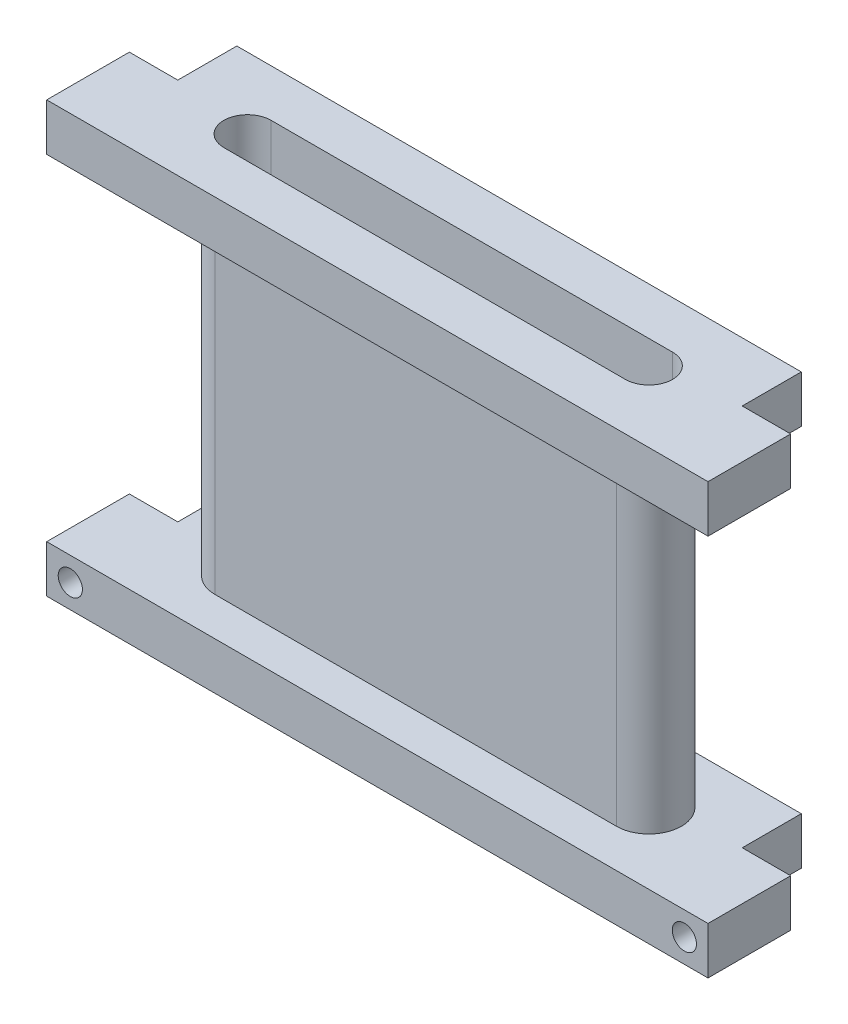
ISO-10303-21;
HEADER;
FILE_DESCRIPTION(('STEP AP214'),'2;1');
FILE_NAME('part.step','',(''),(''),'','','');
FILE_SCHEMA(('AUTOMOTIVE_DESIGN { 1 0 10303 214 1 1 1 1 }'));
ENDSEC;
DATA;
#1=APPLICATION_CONTEXT('core data for automotive mechanical design processes');
#2=APPLICATION_PROTOCOL_DEFINITION('international standard','automotive_design',2000,#1);
#3=PRODUCT_CONTEXT('',#1,'mechanical');
#4=PRODUCT('Part','Part','',(#3));
#5=PRODUCT_RELATED_PRODUCT_CATEGORY('part','',(#4));
#6=PRODUCT_DEFINITION_FORMATION('','',#4);
#7=PRODUCT_DEFINITION_CONTEXT('part definition',#1,'design');
#8=PRODUCT_DEFINITION('design','',#6,#7);
#9=PRODUCT_DEFINITION_SHAPE('','',#8);
#10=(LENGTH_UNIT() NAMED_UNIT(*) SI_UNIT(.MILLI.,.METRE.));
#11=(NAMED_UNIT(*) PLANE_ANGLE_UNIT() SI_UNIT($,.RADIAN.));
#12=(NAMED_UNIT(*) SI_UNIT($,.STERADIAN.) SOLID_ANGLE_UNIT());
#13=UNCERTAINTY_MEASURE_WITH_UNIT(LENGTH_MEASURE(1.E-05),#10,'distance_accuracy_value','');
#14=(GEOMETRIC_REPRESENTATION_CONTEXT(3) GLOBAL_UNCERTAINTY_ASSIGNED_CONTEXT((#13)) GLOBAL_UNIT_ASSIGNED_CONTEXT((#10,
#11,#12)) REPRESENTATION_CONTEXT('',''));
#15=CARTESIAN_POINT('',(0.,0.,0.));
#16=DIRECTION('',(0.,0.,1.));
#17=DIRECTION('',(1.,0.,0.));
#18=AXIS2_PLACEMENT_3D('',#15,#16,#17);
#19=CARTESIAN_POINT('',(-28.,-4.,2.750000002));
#20=DIRECTION('',(0.,0.,1.));
#21=DIRECTION('',(1.,0.,0.));
#22=AXIS2_PLACEMENT_3D('',#19,#20,#21);
#23=PLANE('',#22);
#24=DIRECTION('',(0.,-1.,0.));
#25=VECTOR('',#24,1.);
#26=CARTESIAN_POINT('',(-17.,28.4,2.75));
#27=LINE('',#26,#25);
#28=CARTESIAN_POINT('',(-17.,28.4,2.75));
#29=VERTEX_POINT('',#28);
#30=CARTESIAN_POINT('',(-17.,0.,2.750000002));
#31=VERTEX_POINT('',#30);
#32=EDGE_CURVE('E387',#29,#31,#27,.T.);
#33=ORIENTED_EDGE('',*,*,#32,.T.);
#34=DIRECTION('',(-1.,0.,0.));
#35=VECTOR('',#34,1.);
#36=CARTESIAN_POINT('',(-28.,0.,2.750000002));
#37=LINE('',#36,#35);
#38=CARTESIAN_POINT('',(17.,0.,2.750000002));
#39=VERTEX_POINT('',#38);
#40=EDGE_CURVE('E317',#39,#31,#37,.T.);
#41=ORIENTED_EDGE('',*,*,#40,.F.);
#42=DIRECTION('',(0.,-1.,0.));
#43=VECTOR('',#42,1.);
#44=CARTESIAN_POINT('',(17.,28.4,2.75));
#45=LINE('',#44,#43);
#46=CARTESIAN_POINT('',(17.,28.4,2.75));
#47=VERTEX_POINT('',#46);
#48=EDGE_CURVE('E374',#47,#39,#45,.T.);
#49=ORIENTED_EDGE('',*,*,#48,.F.);
#50=DIRECTION('',(1.,0.,0.));
#51=VECTOR('',#50,1.);
#52=CARTESIAN_POINT('',(17.,28.4,2.75));
#53=LINE('',#52,#51);
#54=EDGE_CURVE('E371',#29,#47,#53,.T.);
#55=ORIENTED_EDGE('',*,*,#54,.F.);
#56=EDGE_LOOP('',(#33,#41,#49,#55));
#57=FACE_BOUND('',#56,.T.);
#58=ADVANCED_FACE('F32',(#57),#23,.T.);
#59=CARTESIAN_POINT('',(28.,-4.,-6.));
#60=DIRECTION('',(0.,0.,-1.));
#61=DIRECTION('',(-1.,0.,0.));
#62=AXIS2_PLACEMENT_3D('',#59,#60,#61);
#63=PLANE('',#62);
#64=DIRECTION('',(0.,-1.,0.));
#65=VECTOR('',#64,1.);
#66=CARTESIAN_POINT('',(-23.899999996,32.4,-6.));
#67=LINE('',#66,#65);
#68=CARTESIAN_POINT('',(-23.899999996,0.,-6.));
#69=VERTEX_POINT('',#68);
#70=CARTESIAN_POINT('',(-23.899999996,-4.,-6.));
#71=VERTEX_POINT('',#70);
#72=EDGE_CURVE('E253',#69,#71,#67,.T.);
#73=ORIENTED_EDGE('',*,*,#72,.F.);
#74=DIRECTION('',(-1.,0.,0.));
#75=VECTOR('',#74,1.);
#76=CARTESIAN_POINT('',(28.,0.,-6.));
#77=LINE('',#76,#75);
#78=CARTESIAN_POINT('',(23.899999996,0.,-6.));
#79=VERTEX_POINT('',#78);
#80=EDGE_CURVE('E407',#79,#69,#77,.T.);
#81=ORIENTED_EDGE('',*,*,#80,.F.);
#82=DIRECTION('',(0.,-1.,0.));
#83=VECTOR('',#82,1.);
#84=CARTESIAN_POINT('',(23.899999996,32.4,-6.));
#85=LINE('',#84,#83);
#86=CARTESIAN_POINT('',(23.899999996,-4.,-6.));
#87=VERTEX_POINT('',#86);
#88=EDGE_CURVE('E274',#79,#87,#85,.T.);
#89=ORIENTED_EDGE('',*,*,#88,.T.);
#90=DIRECTION('',(-1.,0.,0.));
#91=VECTOR('',#90,1.);
#92=CARTESIAN_POINT('',(28.,-4.,-6.));
#93=LINE('',#92,#91);
#94=EDGE_CURVE('E404',#87,#71,#93,.T.);
#95=ORIENTED_EDGE('',*,*,#94,.T.);
#96=EDGE_LOOP('',(#73,#81,#89,#95));
#97=FACE_BOUND('',#96,.T.);
#98=ADVANCED_FACE('F34',(#97),#63,.T.);
#99=CARTESIAN_POINT('',(28.,-4.,2.750000002));
#100=DIRECTION('',(1.,0.,0.));
#101=DIRECTION('',(0.,0.,-1.));
#102=AXIS2_PLACEMENT_3D('',#99,#100,#101);
#103=PLANE('',#102);
#104=DIRECTION('',(0.,-1.,0.));
#105=VECTOR('',#104,1.);
#106=CARTESIAN_POINT('',(28.,32.4,-0.999999998999999));
#107=LINE('',#106,#105);
#108=CARTESIAN_POINT('',(28.,0.,-0.999999998999999));
#109=VERTEX_POINT('',#108);
#110=CARTESIAN_POINT('',(28.,-4.,-0.999999998999999));
#111=VERTEX_POINT('',#110);
#112=EDGE_CURVE('E271',#109,#111,#107,.T.);
#113=ORIENTED_EDGE('',*,*,#112,.F.);
#114=DIRECTION('',(0.,0.,-1.));
#115=VECTOR('',#114,1.);
#116=CARTESIAN_POINT('',(28.,0.,2.750000002));
#117=LINE('',#116,#115);
#118=CARTESIAN_POINT('',(28.,0.,6.));
#119=VERTEX_POINT('',#118);
#120=EDGE_CURVE('E401',#119,#109,#117,.T.);
#121=ORIENTED_EDGE('',*,*,#120,.F.);
#122=DIRECTION('',(0.,1.,0.));
#123=VECTOR('',#122,1.);
#124=CARTESIAN_POINT('',(28.,0.,6.));
#125=LINE('',#124,#123);
#126=CARTESIAN_POINT('',(28.,-4.,6.));
#127=VERTEX_POINT('',#126);
#128=EDGE_CURVE('E318',#127,#119,#125,.T.);
#129=ORIENTED_EDGE('',*,*,#128,.F.);
#130=DIRECTION('',(0.,0.,-1.));
#131=VECTOR('',#130,1.);
#132=CARTESIAN_POINT('',(28.,-4.,2.750000002));
#133=LINE('',#132,#131);
#134=EDGE_CURVE('E11',#127,#111,#133,.T.);
#135=ORIENTED_EDGE('',*,*,#134,.T.);
#136=EDGE_LOOP('',(#113,#121,#129,#135));
#137=FACE_BOUND('',#136,.T.);
#138=ADVANCED_FACE('F430',(#137),#103,.T.);
#139=CARTESIAN_POINT('',(-28.,-4.,-6.));
#140=DIRECTION('',(-1.,0.,0.));
#141=DIRECTION('',(0.,0.,1.));
#142=AXIS2_PLACEMENT_3D('',#139,#140,#141);
#143=PLANE('',#142);
#144=DIRECTION('',(0.,-1.,0.));
#145=VECTOR('',#144,1.);
#146=CARTESIAN_POINT('',(-28.,32.4,-1.));
#147=LINE('',#146,#145);
#148=CARTESIAN_POINT('',(-28.,0.,-1.));
#149=VERTEX_POINT('',#148);
#150=CARTESIAN_POINT('',(-28.,-4.,-1.));
#151=VERTEX_POINT('',#150);
#152=EDGE_CURVE('E254',#149,#151,#147,.T.);
#153=ORIENTED_EDGE('',*,*,#152,.T.);
#154=DIRECTION('',(0.,0.,1.));
#155=VECTOR('',#154,1.);
#156=CARTESIAN_POINT('',(-28.,-4.,-6.));
#157=LINE('',#156,#155);
#158=CARTESIAN_POINT('',(-28.,-4.,6.));
#159=VERTEX_POINT('',#158);
#160=EDGE_CURVE('E41',#151,#159,#157,.T.);
#161=ORIENTED_EDGE('',*,*,#160,.T.);
#162=DIRECTION('',(0.,-1.,0.));
#163=VECTOR('',#162,1.);
#164=CARTESIAN_POINT('',(-28.,-4.,6.));
#165=LINE('',#164,#163);
#166=CARTESIAN_POINT('',(-28.,0.,6.));
#167=VERTEX_POINT('',#166);
#168=EDGE_CURVE('E324',#167,#159,#165,.T.);
#169=ORIENTED_EDGE('',*,*,#168,.F.);
#170=DIRECTION('',(0.,0.,1.));
#171=VECTOR('',#170,1.);
#172=CARTESIAN_POINT('',(-28.,0.,-6.));
#173=LINE('',#172,#171);
#174=EDGE_CURVE('E405',#149,#167,#173,.T.);
#175=ORIENTED_EDGE('',*,*,#174,.F.);
#176=EDGE_LOOP('',(#153,#161,#169,#175));
#177=FACE_BOUND('',#176,.T.);
#178=ADVANCED_FACE('F434',(#177),#143,.T.);
#179=CARTESIAN_POINT('',(0.,-4.,0.));
#180=DIRECTION('',(0.,1.,0.));
#181=DIRECTION('',(0.,0.,1.));
#182=AXIS2_PLACEMENT_3D('',#179,#180,#181);
#183=PLANE('',#182);
#184=DIRECTION('',(1.,0.,0.));
#185=VECTOR('',#184,1.);
#186=CARTESIAN_POINT('',(-17.,-4.,-2.000000002));
#187=LINE('',#186,#185);
#188=CARTESIAN_POINT('',(-17.,-4.,-2.000000002));
#189=VERTEX_POINT('',#188);
#190=CARTESIAN_POINT('',(17.,-4.,-2.000000002));
#191=VERTEX_POINT('',#190);
#192=EDGE_CURVE('E233',#189,#191,#187,.T.);
#193=ORIENTED_EDGE('',*,*,#192,.F.);
#194=CARTESIAN_POINT('',(-17.,-4.,0.));
#195=DIRECTION('',(0.,-1.,0.));
#196=DIRECTION('',(0.,0.,-1.));
#197=AXIS2_PLACEMENT_3D('',#194,#195,#196);
#198=CIRCLE('',#197,2.000000002);
#199=CARTESIAN_POINT('',(-17.,-4.,2.000000002));
#200=VERTEX_POINT('',#199);
#201=EDGE_CURVE('E49',#200,#189,#198,.T.);
#202=ORIENTED_EDGE('',*,*,#201,.F.);
#203=DIRECTION('',(-1.,0.,0.));
#204=VECTOR('',#203,1.);
#205=CARTESIAN_POINT('',(17.,-4.,2.000000002));
#206=LINE('',#205,#204);
#207=CARTESIAN_POINT('',(17.,-4.,2.000000002));
#208=VERTEX_POINT('',#207);
#209=EDGE_CURVE('E224',#208,#200,#206,.T.);
#210=ORIENTED_EDGE('',*,*,#209,.F.);
#211=CARTESIAN_POINT('',(17.,-4.,0.));
#212=DIRECTION('',(0.,-1.,0.));
#213=DIRECTION('',(0.,0.,-1.));
#214=AXIS2_PLACEMENT_3D('',#211,#212,#213);
#215=CIRCLE('',#214,2.000000002);
#216=EDGE_CURVE('E236',#191,#208,#215,.T.);
#217=ORIENTED_EDGE('',*,*,#216,.F.);
#218=EDGE_LOOP('',(#193,#202,#210,#217));
#219=FACE_BOUND('',#218,.T.);
#220=ORIENTED_EDGE('',*,*,#160,.F.);
#221=DIRECTION('',(-1.,0.,0.));
#222=VECTOR('',#221,1.);
#223=CARTESIAN_POINT('',(-23.899999996,-4.,-0.999999999999999));
#224=LINE('',#223,#222);
#225=CARTESIAN_POINT('',(-23.899999996,-4.,-0.999999999999999));
#226=VERTEX_POINT('',#225);
#227=EDGE_CURVE('E251',#226,#151,#224,.T.);
#228=ORIENTED_EDGE('',*,*,#227,.F.);
#229=DIRECTION('',(0.,0.,1.));
#230=VECTOR('',#229,1.);
#231=CARTESIAN_POINT('',(-23.899999996,-4.,-6.));
#232=LINE('',#231,#230);
#233=EDGE_CURVE('E243',#71,#226,#232,.T.);
#234=ORIENTED_EDGE('',*,*,#233,.F.);
#235=ORIENTED_EDGE('',*,*,#94,.F.);
#236=DIRECTION('',(0.,0.,-1.));
#237=VECTOR('',#236,1.);
#238=CARTESIAN_POINT('',(23.899999996,-4.,-0.999999999));
#239=LINE('',#238,#237);
#240=CARTESIAN_POINT('',(23.899999996,-4.,-0.999999999));
#241=VERTEX_POINT('',#240);
#242=EDGE_CURVE('E268',#241,#87,#239,.T.);
#243=ORIENTED_EDGE('',*,*,#242,.F.);
#244=DIRECTION('',(-1.,0.,0.));
#245=VECTOR('',#244,1.);
#246=CARTESIAN_POINT('',(28.,-4.,-0.999999998999999));
#247=LINE('',#246,#245);
#248=EDGE_CURVE('E265',#111,#241,#247,.T.);
#249=ORIENTED_EDGE('',*,*,#248,.F.);
#250=ORIENTED_EDGE('',*,*,#134,.F.);
#251=DIRECTION('',(1.,0.,0.));
#252=VECTOR('',#251,1.);
#253=CARTESIAN_POINT('',(28.,-4.,6.));
#254=LINE('',#253,#252);
#255=EDGE_CURVE('E327',#159,#127,#254,.T.);
#256=ORIENTED_EDGE('',*,*,#255,.F.);
#257=EDGE_LOOP('',(#220,#228,#234,#235,#243,#249,#250,#256));
#258=FACE_BOUND('',#257,.T.);
#259=ADVANCED_FACE('F436',(#219,#258),#183,.F.);
#260=CARTESIAN_POINT('',(0.,0.,0.));
#261=DIRECTION('',(0.,1.,0.));
#262=DIRECTION('',(0.,0.,1.));
#263=AXIS2_PLACEMENT_3D('',#260,#261,#262);
#264=PLANE('',#263);
#265=DIRECTION('',(1.,0.,0.));
#266=VECTOR('',#265,1.);
#267=CARTESIAN_POINT('',(0.,0.,-0.999999999999996));
#268=LINE('',#267,#266);
#269=CARTESIAN_POINT('',(-23.899999996,0.,-0.999999999999999));
#270=VERTEX_POINT('',#269);
#271=EDGE_CURVE('E257',#149,#270,#268,.T.);
#272=ORIENTED_EDGE('',*,*,#271,.F.);
#273=ORIENTED_EDGE('',*,*,#174,.T.);
#274=DIRECTION('',(-1.,0.,0.));
#275=VECTOR('',#274,1.);
#276=CARTESIAN_POINT('',(-28.,0.,6.));
#277=LINE('',#276,#275);
#278=EDGE_CURVE('E321',#119,#167,#277,.T.);
#279=ORIENTED_EDGE('',*,*,#278,.F.);
#280=ORIENTED_EDGE('',*,*,#120,.T.);
#281=DIRECTION('',(1.,0.,0.));
#282=VECTOR('',#281,1.);
#283=CARTESIAN_POINT('',(0.,0.,-0.999999999000003));
#284=LINE('',#283,#282);
#285=CARTESIAN_POINT('',(23.899999996,0.,-0.999999999));
#286=VERTEX_POINT('',#285);
#287=EDGE_CURVE('E279',#286,#109,#284,.T.);
#288=ORIENTED_EDGE('',*,*,#287,.F.);
#289=DIRECTION('',(0.,0.,1.));
#290=VECTOR('',#289,1.);
#291=CARTESIAN_POINT('',(23.899999996,0.,0.));
#292=LINE('',#291,#290);
#293=EDGE_CURVE('E273',#79,#286,#292,.T.);
#294=ORIENTED_EDGE('',*,*,#293,.F.);
#295=ORIENTED_EDGE('',*,*,#80,.T.);
#296=DIRECTION('',(0.,0.,-1.));
#297=VECTOR('',#296,1.);
#298=CARTESIAN_POINT('',(-23.899999996,0.,0.));
#299=LINE('',#298,#297);
#300=EDGE_CURVE('E263',#270,#69,#299,.T.);
#301=ORIENTED_EDGE('',*,*,#300,.F.);
#302=EDGE_LOOP('',(#272,#273,#279,#280,#288,#294,#295,#301));
#303=FACE_BOUND('',#302,.T.);
#304=CARTESIAN_POINT('',(17.,0.,0.));
#305=DIRECTION('',(0.,1.,0.));
#306=DIRECTION('',(0.,0.,-1.));
#307=AXIS2_PLACEMENT_3D('',#304,#305,#306);
#308=CIRCLE('',#307,2.75);
#309=CARTESIAN_POINT('',(17.,0.,-2.75));
#310=VERTEX_POINT('',#309);
#311=EDGE_CURVE('E358',#39,#310,#308,.T.);
#312=ORIENTED_EDGE('',*,*,#311,.F.);
#313=ORIENTED_EDGE('',*,*,#40,.T.);
#314=CARTESIAN_POINT('',(-17.,0.,0.));
#315=DIRECTION('',(0.,1.,0.));
#316=DIRECTION('',(0.,0.,-1.));
#317=AXIS2_PLACEMENT_3D('',#314,#315,#316);
#318=CIRCLE('',#317,2.75);
#319=CARTESIAN_POINT('',(-17.,0.,-2.75));
#320=VERTEX_POINT('',#319);
#321=EDGE_CURVE('E365',#320,#31,#318,.T.);
#322=ORIENTED_EDGE('',*,*,#321,.F.);
#323=DIRECTION('',(-1.,0.,0.));
#324=VECTOR('',#323,1.);
#325=CARTESIAN_POINT('',(-17.,0.,-2.75));
#326=LINE('',#325,#324);
#327=EDGE_CURVE('E375',#310,#320,#326,.T.);
#328=ORIENTED_EDGE('',*,*,#327,.F.);
#329=EDGE_LOOP('',(#312,#313,#322,#328));
#330=FACE_BOUND('',#329,.T.);
#331=ADVANCED_FACE('F419',(#303,#330),#264,.T.);
#332=CARTESIAN_POINT('',(17.,28.4,0.));
#333=DIRECTION('',(0.,-1.,0.));
#334=DIRECTION('',(0.,0.,-1.));
#335=AXIS2_PLACEMENT_3D('',#332,#333,#334);
#336=CYLINDRICAL_SURFACE('',#335,2.75);
#337=ORIENTED_EDGE('',*,*,#311,.T.);
#338=DIRECTION('',(0.,-1.,0.));
#339=VECTOR('',#338,1.);
#340=CARTESIAN_POINT('',(17.,28.4,-2.75));
#341=LINE('',#340,#339);
#342=CARTESIAN_POINT('',(17.,28.4,-2.75));
#343=VERTEX_POINT('',#342);
#344=EDGE_CURVE('E392',#343,#310,#341,.T.);
#345=ORIENTED_EDGE('',*,*,#344,.F.);
#346=CARTESIAN_POINT('',(17.,28.4,0.));
#347=DIRECTION('',(0.,1.,0.));
#348=DIRECTION('',(0.,0.,-1.));
#349=AXIS2_PLACEMENT_3D('',#346,#347,#348);
#350=CIRCLE('',#349,2.75);
#351=EDGE_CURVE('E361',#47,#343,#350,.T.);
#352=ORIENTED_EDGE('',*,*,#351,.F.);
#353=ORIENTED_EDGE('',*,*,#48,.T.);
#354=EDGE_LOOP('',(#337,#345,#352,#353));
#355=FACE_BOUND('',#354,.T.);
#356=ADVANCED_FACE('F417',(#355),#336,.T.);
#357=CARTESIAN_POINT('',(-17.,28.4,-2.75));
#358=DIRECTION('',(0.,0.,1.));
#359=DIRECTION('',(1.,0.,0.));
#360=AXIS2_PLACEMENT_3D('',#357,#358,#359);
#361=PLANE('',#360);
#362=ORIENTED_EDGE('',*,*,#327,.T.);
#363=DIRECTION('',(0.,-1.,0.));
#364=VECTOR('',#363,1.);
#365=CARTESIAN_POINT('',(-17.,28.4,-2.75));
#366=LINE('',#365,#364);
#367=CARTESIAN_POINT('',(-17.,28.4,-2.75));
#368=VERTEX_POINT('',#367);
#369=EDGE_CURVE('E380',#368,#320,#366,.T.);
#370=ORIENTED_EDGE('',*,*,#369,.F.);
#371=DIRECTION('',(-1.,0.,0.));
#372=VECTOR('',#371,1.);
#373=CARTESIAN_POINT('',(-17.,28.4,-2.75));
#374=LINE('',#373,#372);
#375=EDGE_CURVE('E364',#343,#368,#374,.T.);
#376=ORIENTED_EDGE('',*,*,#375,.F.);
#377=ORIENTED_EDGE('',*,*,#344,.T.);
#378=EDGE_LOOP('',(#362,#370,#376,#377));
#379=FACE_BOUND('',#378,.T.);
#380=ADVANCED_FACE('F415',(#379),#361,.F.);
#381=CARTESIAN_POINT('',(-17.,28.4,0.));
#382=DIRECTION('',(0.,-1.,0.));
#383=DIRECTION('',(0.,0.,-1.));
#384=AXIS2_PLACEMENT_3D('',#381,#382,#383);
#385=CYLINDRICAL_SURFACE('',#384,2.75);
#386=ORIENTED_EDGE('',*,*,#321,.T.);
#387=ORIENTED_EDGE('',*,*,#32,.F.);
#388=CARTESIAN_POINT('',(-17.,28.4,0.));
#389=DIRECTION('',(0.,1.,0.));
#390=DIRECTION('',(0.,0.,-1.));
#391=AXIS2_PLACEMENT_3D('',#388,#389,#390);
#392=CIRCLE('',#391,2.75);
#393=EDGE_CURVE('E368',#368,#29,#392,.T.);
#394=ORIENTED_EDGE('',*,*,#393,.F.);
#395=ORIENTED_EDGE('',*,*,#369,.T.);
#396=EDGE_LOOP('',(#386,#387,#394,#395));
#397=FACE_BOUND('',#396,.T.);
#398=ADVANCED_FACE('F421',(#397),#385,.T.);
#399=CARTESIAN_POINT('',(28.,32.4,-6.));
#400=DIRECTION('',(1.,0.,0.));
#401=DIRECTION('',(0.,0.,-1.));
#402=AXIS2_PLACEMENT_3D('',#399,#400,#401);
#403=PLANE('',#402);
#404=DIRECTION('',(0.,1.,0.));
#405=VECTOR('',#404,1.);
#406=CARTESIAN_POINT('',(28.,-4.001,-0.999999999));
#407=LINE('',#406,#405);
#408=CARTESIAN_POINT('',(28.,28.4,-0.999999999));
#409=VERTEX_POINT('',#408);
#410=CARTESIAN_POINT('',(28.,32.4,-0.999999999));
#411=VERTEX_POINT('',#410);
#412=EDGE_CURVE('E290',#409,#411,#407,.T.);
#413=ORIENTED_EDGE('',*,*,#412,.T.);
#414=DIRECTION('',(0.,0.,1.));
#415=VECTOR('',#414,1.);
#416=CARTESIAN_POINT('',(28.,32.4,-6.));
#417=LINE('',#416,#415);
#418=CARTESIAN_POINT('',(28.,32.4,6.));
#419=VERTEX_POINT('',#418);
#420=EDGE_CURVE('E334',#411,#419,#417,.T.);
#421=ORIENTED_EDGE('',*,*,#420,.T.);
#422=DIRECTION('',(0.,-1.,0.));
#423=VECTOR('',#422,1.);
#424=CARTESIAN_POINT('',(28.,32.4,6.));
#425=LINE('',#424,#423);
#426=CARTESIAN_POINT('',(28.,28.4,6.));
#427=VERTEX_POINT('',#426);
#428=EDGE_CURVE('E346',#419,#427,#425,.T.);
#429=ORIENTED_EDGE('',*,*,#428,.T.);
#430=DIRECTION('',(0.,0.,1.));
#431=VECTOR('',#430,1.);
#432=CARTESIAN_POINT('',(28.,28.4,-6.));
#433=LINE('',#432,#431);
#434=EDGE_CURVE('E330',#409,#427,#433,.T.);
#435=ORIENTED_EDGE('',*,*,#434,.F.);
#436=EDGE_LOOP('',(#413,#421,#429,#435));
#437=FACE_BOUND('',#436,.T.);
#438=ADVANCED_FACE('F515',(#437),#403,.T.);
#439=CARTESIAN_POINT('',(-28.,32.4,-6.));
#440=DIRECTION('',(0.,0.,-1.));
#441=DIRECTION('',(-1.,0.,0.));
#442=AXIS2_PLACEMENT_3D('',#439,#440,#441);
#443=PLANE('',#442);
#444=DIRECTION('',(0.,1.,0.));
#445=VECTOR('',#444,1.);
#446=CARTESIAN_POINT('',(23.899999996,-4.001,-6.));
#447=LINE('',#446,#445);
#448=CARTESIAN_POINT('',(23.899999996,28.4,-6.));
#449=VERTEX_POINT('',#448);
#450=CARTESIAN_POINT('',(23.899999996,32.4,-6.));
#451=VERTEX_POINT('',#450);
#452=EDGE_CURVE('E289',#449,#451,#447,.T.);
#453=ORIENTED_EDGE('',*,*,#452,.F.);
#454=DIRECTION('',(1.,0.,0.));
#455=VECTOR('',#454,1.);
#456=CARTESIAN_POINT('',(-28.,28.4,-6.));
#457=LINE('',#456,#455);
#458=CARTESIAN_POINT('',(-23.899999996,28.4,-6.));
#459=VERTEX_POINT('',#458);
#460=EDGE_CURVE('E337',#459,#449,#457,.T.);
#461=ORIENTED_EDGE('',*,*,#460,.F.);
#462=DIRECTION('',(0.,1.,0.));
#463=VECTOR('',#462,1.);
#464=CARTESIAN_POINT('',(-23.899999996,-4.001,-6.));
#465=LINE('',#464,#463);
#466=CARTESIAN_POINT('',(-23.899999996,32.4,-6.));
#467=VERTEX_POINT('',#466);
#468=EDGE_CURVE('E308',#459,#467,#465,.T.);
#469=ORIENTED_EDGE('',*,*,#468,.T.);
#470=DIRECTION('',(1.,0.,0.));
#471=VECTOR('',#470,1.);
#472=CARTESIAN_POINT('',(-28.,32.4,-6.));
#473=LINE('',#472,#471);
#474=EDGE_CURVE('E343',#467,#451,#473,.T.);
#475=ORIENTED_EDGE('',*,*,#474,.T.);
#476=EDGE_LOOP('',(#453,#461,#469,#475));
#477=FACE_BOUND('',#476,.T.);
#478=ADVANCED_FACE('F511',(#477),#443,.T.);
#479=CARTESIAN_POINT('',(-28.,32.4,6.));
#480=DIRECTION('',(-1.,0.,0.));
#481=DIRECTION('',(0.,0.,1.));
#482=AXIS2_PLACEMENT_3D('',#479,#480,#481);
#483=PLANE('',#482);
#484=DIRECTION('',(0.,1.,0.));
#485=VECTOR('',#484,1.);
#486=CARTESIAN_POINT('',(-28.,-4.001,-1.));
#487=LINE('',#486,#485);
#488=CARTESIAN_POINT('',(-28.,28.4,-1.));
#489=VERTEX_POINT('',#488);
#490=CARTESIAN_POINT('',(-28.,32.4,-1.));
#491=VERTEX_POINT('',#490);
#492=EDGE_CURVE('E307',#489,#491,#487,.T.);
#493=ORIENTED_EDGE('',*,*,#492,.F.);
#494=DIRECTION('',(0.,0.,-1.));
#495=VECTOR('',#494,1.);
#496=CARTESIAN_POINT('',(-28.,28.4,6.));
#497=LINE('',#496,#495);
#498=CARTESIAN_POINT('',(-28.,28.4,6.));
#499=VERTEX_POINT('',#498);
#500=EDGE_CURVE('E351',#499,#489,#497,.T.);
#501=ORIENTED_EDGE('',*,*,#500,.F.);
#502=DIRECTION('',(0.,-1.,0.));
#503=VECTOR('',#502,1.);
#504=CARTESIAN_POINT('',(-28.,32.4,6.));
#505=LINE('',#504,#503);
#506=CARTESIAN_POINT('',(-28.,32.4,6.));
#507=VERTEX_POINT('',#506);
#508=EDGE_CURVE('E356',#507,#499,#505,.T.);
#509=ORIENTED_EDGE('',*,*,#508,.F.);
#510=DIRECTION('',(0.,0.,-1.));
#511=VECTOR('',#510,1.);
#512=CARTESIAN_POINT('',(-28.,32.4,6.));
#513=LINE('',#512,#511);
#514=EDGE_CURVE('E340',#507,#491,#513,.T.);
#515=ORIENTED_EDGE('',*,*,#514,.T.);
#516=EDGE_LOOP('',(#493,#501,#509,#515));
#517=FACE_BOUND('',#516,.T.);
#518=ADVANCED_FACE('F514',(#517),#483,.T.);
#519=CARTESIAN_POINT('',(28.,32.4,6.));
#520=DIRECTION('',(0.,0.,1.));
#521=DIRECTION('',(1.,0.,0.));
#522=AXIS2_PLACEMENT_3D('',#519,#520,#521);
#523=PLANE('',#522);
#524=DIRECTION('',(-1.,0.,0.));
#525=VECTOR('',#524,1.);
#526=CARTESIAN_POINT('',(28.,28.4,6.));
#527=LINE('',#526,#525);
#528=EDGE_CURVE('E348',#427,#499,#527,.T.);
#529=ORIENTED_EDGE('',*,*,#528,.F.);
#530=ORIENTED_EDGE('',*,*,#428,.F.);
#531=DIRECTION('',(-1.,0.,0.));
#532=VECTOR('',#531,1.);
#533=CARTESIAN_POINT('',(28.,32.4,6.));
#534=LINE('',#533,#532);
#535=EDGE_CURVE('E336',#419,#507,#534,.T.);
#536=ORIENTED_EDGE('',*,*,#535,.T.);
#537=ORIENTED_EDGE('',*,*,#508,.T.);
#538=EDGE_LOOP('',(#529,#530,#536,#537));
#539=FACE_BOUND('',#538,.T.);
#540=ADVANCED_FACE('F506',(#539),#523,.T.);
#541=CARTESIAN_POINT('',(0.,32.4,0.));
#542=DIRECTION('',(0.,-1.,0.));
#543=DIRECTION('',(0.,0.,-1.));
#544=AXIS2_PLACEMENT_3D('',#541,#542,#543);
#545=PLANE('',#544);
#546=DIRECTION('',(-1.,0.,0.));
#547=VECTOR('',#546,1.);
#548=CARTESIAN_POINT('',(17.,32.4,2.000000002));
#549=LINE('',#548,#547);
#550=CARTESIAN_POINT('',(17.,32.4,2.000000002));
#551=VERTEX_POINT('',#550);
#552=CARTESIAN_POINT('',(-17.,32.4,2.000000002));
#553=VERTEX_POINT('',#552);
#554=EDGE_CURVE('E228',#551,#553,#549,.T.);
#555=ORIENTED_EDGE('',*,*,#554,.T.);
#556=CARTESIAN_POINT('',(-17.,32.4,0.));
#557=DIRECTION('',(0.,-1.,0.));
#558=DIRECTION('',(0.,0.,-1.));
#559=AXIS2_PLACEMENT_3D('',#556,#557,#558);
#560=CIRCLE('',#559,2.000000002);
#561=CARTESIAN_POINT('',(-17.,32.4,-2.000000002));
#562=VERTEX_POINT('',#561);
#563=EDGE_CURVE('E220',#553,#562,#560,.T.);
#564=ORIENTED_EDGE('',*,*,#563,.T.);
#565=DIRECTION('',(1.,0.,0.));
#566=VECTOR('',#565,1.);
#567=CARTESIAN_POINT('',(-17.,32.4,-2.000000002));
#568=LINE('',#567,#566);
#569=CARTESIAN_POINT('',(17.,32.4,-2.000000002));
#570=VERTEX_POINT('',#569);
#571=EDGE_CURVE('E223',#562,#570,#568,.T.);
#572=ORIENTED_EDGE('',*,*,#571,.T.);
#573=CARTESIAN_POINT('',(17.,32.4,0.));
#574=DIRECTION('',(0.,-1.,0.));
#575=DIRECTION('',(0.,0.,-1.));
#576=AXIS2_PLACEMENT_3D('',#573,#574,#575);
#577=CIRCLE('',#576,2.000000002);
#578=EDGE_CURVE('E57',#570,#551,#577,.T.);
#579=ORIENTED_EDGE('',*,*,#578,.T.);
#580=EDGE_LOOP('',(#555,#564,#572,#579));
#581=FACE_BOUND('',#580,.T.);
#582=DIRECTION('',(1.,0.,0.));
#583=VECTOR('',#582,1.);
#584=CARTESIAN_POINT('',(23.899999996,32.4,-0.999999998999999));
#585=LINE('',#584,#583);
#586=CARTESIAN_POINT('',(23.899999996,32.4,-0.999999998999999));
#587=VERTEX_POINT('',#586);
#588=EDGE_CURVE('E287',#587,#411,#585,.T.);
#589=ORIENTED_EDGE('',*,*,#588,.F.);
#590=DIRECTION('',(0.,0.,1.));
#591=VECTOR('',#590,1.);
#592=CARTESIAN_POINT('',(23.899999996,32.4,-6.));
#593=LINE('',#592,#591);
#594=EDGE_CURVE('E284',#451,#587,#593,.T.);
#595=ORIENTED_EDGE('',*,*,#594,.F.);
#596=ORIENTED_EDGE('',*,*,#474,.F.);
#597=DIRECTION('',(0.,0.,-1.));
#598=VECTOR('',#597,1.);
#599=CARTESIAN_POINT('',(-23.899999996,32.4,-1.));
#600=LINE('',#599,#598);
#601=CARTESIAN_POINT('',(-23.899999996,32.4,-1.));
#602=VERTEX_POINT('',#601);
#603=EDGE_CURVE('E305',#602,#467,#600,.T.);
#604=ORIENTED_EDGE('',*,*,#603,.F.);
#605=DIRECTION('',(1.,0.,0.));
#606=VECTOR('',#605,1.);
#607=CARTESIAN_POINT('',(-28.,32.4,-1.));
#608=LINE('',#607,#606);
#609=EDGE_CURVE('E302',#491,#602,#608,.T.);
#610=ORIENTED_EDGE('',*,*,#609,.F.);
#611=ORIENTED_EDGE('',*,*,#514,.F.);
#612=ORIENTED_EDGE('',*,*,#535,.F.);
#613=ORIENTED_EDGE('',*,*,#420,.F.);
#614=EDGE_LOOP('',(#589,#595,#596,#604,#610,#611,#612,#613));
#615=FACE_BOUND('',#614,.T.);
#616=ADVANCED_FACE('F503',(#581,#615),#545,.F.);
#617=CARTESIAN_POINT('',(0.,28.4,0.));
#618=DIRECTION('',(0.,-1.,0.));
#619=DIRECTION('',(0.,0.,-1.));
#620=AXIS2_PLACEMENT_3D('',#617,#618,#619);
#621=PLANE('',#620);
#622=DIRECTION('',(0.,0.,1.));
#623=VECTOR('',#622,1.);
#624=CARTESIAN_POINT('',(23.899999996,28.4,-6.));
#625=LINE('',#624,#623);
#626=CARTESIAN_POINT('',(23.899999996,28.4,-0.999999998999999));
#627=VERTEX_POINT('',#626);
#628=EDGE_CURVE('E293',#449,#627,#625,.T.);
#629=ORIENTED_EDGE('',*,*,#628,.T.);
#630=DIRECTION('',(1.,0.,0.));
#631=VECTOR('',#630,1.);
#632=CARTESIAN_POINT('',(23.899999996,28.4,-0.999999998999999));
#633=LINE('',#632,#631);
#634=EDGE_CURVE('E281',#627,#409,#633,.T.);
#635=ORIENTED_EDGE('',*,*,#634,.T.);
#636=ORIENTED_EDGE('',*,*,#434,.T.);
#637=ORIENTED_EDGE('',*,*,#528,.T.);
#638=ORIENTED_EDGE('',*,*,#500,.T.);
#639=DIRECTION('',(1.,0.,0.));
#640=VECTOR('',#639,1.);
#641=CARTESIAN_POINT('',(-28.,28.4,-1.));
#642=LINE('',#641,#640);
#643=CARTESIAN_POINT('',(-23.899999996,28.4,-1.));
#644=VERTEX_POINT('',#643);
#645=EDGE_CURVE('E311',#489,#644,#642,.T.);
#646=ORIENTED_EDGE('',*,*,#645,.T.);
#647=DIRECTION('',(0.,0.,-1.));
#648=VECTOR('',#647,1.);
#649=CARTESIAN_POINT('',(-23.899999996,28.4,-1.));
#650=LINE('',#649,#648);
#651=EDGE_CURVE('E299',#644,#459,#650,.T.);
#652=ORIENTED_EDGE('',*,*,#651,.T.);
#653=ORIENTED_EDGE('',*,*,#460,.T.);
#654=EDGE_LOOP('',(#629,#635,#636,#637,#638,#646,#652,#653));
#655=FACE_BOUND('',#654,.T.);
#656=ORIENTED_EDGE('',*,*,#393,.T.);
#657=ORIENTED_EDGE('',*,*,#54,.T.);
#658=ORIENTED_EDGE('',*,*,#351,.T.);
#659=ORIENTED_EDGE('',*,*,#375,.T.);
#660=EDGE_LOOP('',(#656,#657,#658,#659));
#661=FACE_BOUND('',#660,.T.);
#662=ADVANCED_FACE('F424',(#655,#661),#621,.T.);
#663=CARTESIAN_POINT('',(0.,0.,6.));
#664=DIRECTION('',(0.,0.,-1.));
#665=DIRECTION('',(-1.,0.,0.));
#666=AXIS2_PLACEMENT_3D('',#663,#664,#665);
#667=PLANE('',#666);
#668=CARTESIAN_POINT('',(26.,-2.,6.));
#669=DIRECTION('',(0.,0.,1.));
#670=DIRECTION('',(1.,0.,0.));
#671=AXIS2_PLACEMENT_3D('',#668,#669,#670);
#672=CIRCLE('',#671,1.02499999999999);
#673=CARTESIAN_POINT('',(27.025,-2.,6.));
#674=VERTEX_POINT('',#673);
#675=EDGE_CURVE('E210',#674,#674,#672,.T.);
#676=ORIENTED_EDGE('',*,*,#675,.F.);
#677=EDGE_LOOP('',(#676));
#678=FACE_BOUND('',#677,.T.);
#679=CARTESIAN_POINT('',(-26.,-2.,6.));
#680=DIRECTION('',(0.,0.,1.));
#681=DIRECTION('',(1.,0.,0.));
#682=AXIS2_PLACEMENT_3D('',#679,#680,#681);
#683=CIRCLE('',#682,1.02499999999999);
#684=CARTESIAN_POINT('',(-24.975,-2.,6.));
#685=VERTEX_POINT('',#684);
#686=EDGE_CURVE('E209',#685,#685,#683,.T.);
#687=ORIENTED_EDGE('',*,*,#686,.F.);
#688=EDGE_LOOP('',(#687));
#689=FACE_BOUND('',#688,.T.);
#690=ORIENTED_EDGE('',*,*,#128,.T.);
#691=ORIENTED_EDGE('',*,*,#278,.T.);
#692=ORIENTED_EDGE('',*,*,#168,.T.);
#693=ORIENTED_EDGE('',*,*,#255,.T.);
#694=EDGE_LOOP('',(#690,#691,#692,#693));
#695=FACE_BOUND('',#694,.T.);
#696=ADVANCED_FACE('F457',(#678,#689,#695),#667,.F.);
#697=CARTESIAN_POINT('',(-28.,-4.001,-1.));
#698=DIRECTION('',(0.,0.,1.));
#699=DIRECTION('',(1.,0.,0.));
#700=AXIS2_PLACEMENT_3D('',#697,#698,#699);
#701=PLANE('',#700);
#702=ORIENTED_EDGE('',*,*,#492,.T.);
#703=ORIENTED_EDGE('',*,*,#609,.T.);
#704=DIRECTION('',(0.,1.,0.));
#705=VECTOR('',#704,1.);
#706=CARTESIAN_POINT('',(-23.899999996,-4.001,-1.));
#707=LINE('',#706,#705);
#708=EDGE_CURVE('E312',#644,#602,#707,.T.);
#709=ORIENTED_EDGE('',*,*,#708,.F.);
#710=ORIENTED_EDGE('',*,*,#645,.F.);
#711=EDGE_LOOP('',(#702,#703,#709,#710));
#712=FACE_BOUND('',#711,.T.);
#713=ADVANCED_FACE('F495',(#712),#701,.F.);
#714=CARTESIAN_POINT('',(-23.899999996,-4.001,-1.));
#715=DIRECTION('',(1.,0.,0.));
#716=DIRECTION('',(0.,0.,-1.));
#717=AXIS2_PLACEMENT_3D('',#714,#715,#716);
#718=PLANE('',#717);
#719=ORIENTED_EDGE('',*,*,#708,.T.);
#720=ORIENTED_EDGE('',*,*,#603,.T.);
#721=ORIENTED_EDGE('',*,*,#468,.F.);
#722=ORIENTED_EDGE('',*,*,#651,.F.);
#723=EDGE_LOOP('',(#719,#720,#721,#722));
#724=FACE_BOUND('',#723,.T.);
#725=ADVANCED_FACE('F491',(#724),#718,.F.);
#726=CARTESIAN_POINT('',(23.899999996,-4.001,-6.));
#727=DIRECTION('',(-1.,0.,0.));
#728=DIRECTION('',(0.,0.,1.));
#729=AXIS2_PLACEMENT_3D('',#726,#727,#728);
#730=PLANE('',#729);
#731=ORIENTED_EDGE('',*,*,#452,.T.);
#732=ORIENTED_EDGE('',*,*,#594,.T.);
#733=DIRECTION('',(0.,1.,0.));
#734=VECTOR('',#733,1.);
#735=CARTESIAN_POINT('',(23.899999996,-4.001,-0.999999998999999));
#736=LINE('',#735,#734);
#737=EDGE_CURVE('E294',#627,#587,#736,.T.);
#738=ORIENTED_EDGE('',*,*,#737,.F.);
#739=ORIENTED_EDGE('',*,*,#628,.F.);
#740=EDGE_LOOP('',(#731,#732,#738,#739));
#741=FACE_BOUND('',#740,.T.);
#742=ADVANCED_FACE('F484',(#741),#730,.F.);
#743=CARTESIAN_POINT('',(23.899999996,-4.001,-0.999999998999999));
#744=DIRECTION('',(0.,0.,1.));
#745=DIRECTION('',(1.,0.,0.));
#746=AXIS2_PLACEMENT_3D('',#743,#744,#745);
#747=PLANE('',#746);
#748=ORIENTED_EDGE('',*,*,#737,.T.);
#749=ORIENTED_EDGE('',*,*,#588,.T.);
#750=ORIENTED_EDGE('',*,*,#412,.F.);
#751=ORIENTED_EDGE('',*,*,#634,.F.);
#752=EDGE_LOOP('',(#748,#749,#750,#751));
#753=FACE_BOUND('',#752,.T.);
#754=ADVANCED_FACE('F477',(#753),#747,.F.);
#755=CARTESIAN_POINT('',(28.,32.4,-0.999999998999999));
#756=DIRECTION('',(0.,0.,1.));
#757=DIRECTION('',(1.,0.,0.));
#758=AXIS2_PLACEMENT_3D('',#755,#756,#757);
#759=PLANE('',#758);
#760=ORIENTED_EDGE('',*,*,#287,.T.);
#761=ORIENTED_EDGE('',*,*,#112,.T.);
#762=ORIENTED_EDGE('',*,*,#248,.T.);
#763=DIRECTION('',(0.,-1.,0.));
#764=VECTOR('',#763,1.);
#765=CARTESIAN_POINT('',(23.899999996,32.4,-0.999999999));
#766=LINE('',#765,#764);
#767=EDGE_CURVE('E270',#286,#241,#766,.T.);
#768=ORIENTED_EDGE('',*,*,#767,.F.);
#769=EDGE_LOOP('',(#760,#761,#762,#768));
#770=FACE_BOUND('',#769,.T.);
#771=ADVANCED_FACE('F475',(#770),#759,.F.);
#772=CARTESIAN_POINT('',(23.899999996,32.4,-0.999999999));
#773=DIRECTION('',(-1.,0.,0.));
#774=DIRECTION('',(0.,0.,1.));
#775=AXIS2_PLACEMENT_3D('',#772,#773,#774);
#776=PLANE('',#775);
#777=ORIENTED_EDGE('',*,*,#293,.T.);
#778=ORIENTED_EDGE('',*,*,#767,.T.);
#779=ORIENTED_EDGE('',*,*,#242,.T.);
#780=ORIENTED_EDGE('',*,*,#88,.F.);
#781=EDGE_LOOP('',(#777,#778,#779,#780));
#782=FACE_BOUND('',#781,.T.);
#783=ADVANCED_FACE('F472',(#782),#776,.F.);
#784=CARTESIAN_POINT('',(-23.899999996,32.4,-6.));
#785=DIRECTION('',(1.,0.,0.));
#786=DIRECTION('',(0.,0.,-1.));
#787=AXIS2_PLACEMENT_3D('',#784,#785,#786);
#788=PLANE('',#787);
#789=ORIENTED_EDGE('',*,*,#300,.T.);
#790=ORIENTED_EDGE('',*,*,#72,.T.);
#791=ORIENTED_EDGE('',*,*,#233,.T.);
#792=DIRECTION('',(0.,-1.,0.));
#793=VECTOR('',#792,1.);
#794=CARTESIAN_POINT('',(-23.899999996,32.4,-0.999999999999999));
#795=LINE('',#794,#793);
#796=EDGE_CURVE('E258',#270,#226,#795,.T.);
#797=ORIENTED_EDGE('',*,*,#796,.F.);
#798=EDGE_LOOP('',(#789,#790,#791,#797));
#799=FACE_BOUND('',#798,.T.);
#800=ADVANCED_FACE('F465',(#799),#788,.F.);
#801=CARTESIAN_POINT('',(-23.899999996,32.4,-0.999999999999999));
#802=DIRECTION('',(0.,0.,1.));
#803=DIRECTION('',(1.,0.,0.));
#804=AXIS2_PLACEMENT_3D('',#801,#802,#803);
#805=PLANE('',#804);
#806=ORIENTED_EDGE('',*,*,#271,.T.);
#807=ORIENTED_EDGE('',*,*,#796,.T.);
#808=ORIENTED_EDGE('',*,*,#227,.T.);
#809=ORIENTED_EDGE('',*,*,#152,.F.);
#810=EDGE_LOOP('',(#806,#807,#808,#809));
#811=FACE_BOUND('',#810,.T.);
#812=ADVANCED_FACE('F463',(#811),#805,.F.);
#813=CARTESIAN_POINT('',(-17.,32.4,0.));
#814=DIRECTION('',(0.,-1.,0.));
#815=DIRECTION('',(0.,0.,-1.));
#816=AXIS2_PLACEMENT_3D('',#813,#814,#815);
#817=CYLINDRICAL_SURFACE('',#816,2.000000002);
#818=ORIENTED_EDGE('',*,*,#201,.T.);
#819=DIRECTION('',(0.,-1.,0.));
#820=VECTOR('',#819,1.);
#821=CARTESIAN_POINT('',(-17.,32.4,-2.000000002));
#822=LINE('',#821,#820);
#823=EDGE_CURVE('E231',#562,#189,#822,.T.);
#824=ORIENTED_EDGE('',*,*,#823,.F.);
#825=ORIENTED_EDGE('',*,*,#563,.F.);
#826=DIRECTION('',(0.,-1.,0.));
#827=VECTOR('',#826,1.);
#828=CARTESIAN_POINT('',(-17.,32.4,2.000000002));
#829=LINE('',#828,#827);
#830=EDGE_CURVE('E241',#553,#200,#829,.T.);
#831=ORIENTED_EDGE('',*,*,#830,.T.);
#832=EDGE_LOOP('',(#818,#824,#825,#831));
#833=FACE_BOUND('',#832,.T.);
#834=ADVANCED_FACE('F681',(#833),#817,.F.);
#835=CARTESIAN_POINT('',(17.,32.4,2.000000002));
#836=DIRECTION('',(0.,0.,1.));
#837=DIRECTION('',(1.,0.,0.));
#838=AXIS2_PLACEMENT_3D('',#835,#836,#837);
#839=PLANE('',#838);
#840=ORIENTED_EDGE('',*,*,#209,.T.);
#841=ORIENTED_EDGE('',*,*,#830,.F.);
#842=ORIENTED_EDGE('',*,*,#554,.F.);
#843=DIRECTION('',(0.,-1.,0.));
#844=VECTOR('',#843,1.);
#845=CARTESIAN_POINT('',(17.,32.4,2.000000002));
#846=LINE('',#845,#844);
#847=EDGE_CURVE('E244',#551,#208,#846,.T.);
#848=ORIENTED_EDGE('',*,*,#847,.T.);
#849=EDGE_LOOP('',(#840,#841,#842,#848));
#850=FACE_BOUND('',#849,.T.);
#851=ADVANCED_FACE('F694',(#850),#839,.F.);
#852=CARTESIAN_POINT('',(17.,32.4,0.));
#853=DIRECTION('',(0.,-1.,0.));
#854=DIRECTION('',(0.,0.,-1.));
#855=AXIS2_PLACEMENT_3D('',#852,#853,#854);
#856=CYLINDRICAL_SURFACE('',#855,2.000000002);
#857=ORIENTED_EDGE('',*,*,#216,.T.);
#858=ORIENTED_EDGE('',*,*,#847,.F.);
#859=ORIENTED_EDGE('',*,*,#578,.F.);
#860=DIRECTION('',(0.,-1.,0.));
#861=VECTOR('',#860,1.);
#862=CARTESIAN_POINT('',(17.,32.4,-2.000000002));
#863=LINE('',#862,#861);
#864=EDGE_CURVE('E246',#570,#191,#863,.T.);
#865=ORIENTED_EDGE('',*,*,#864,.T.);
#866=EDGE_LOOP('',(#857,#858,#859,#865));
#867=FACE_BOUND('',#866,.T.);
#868=ADVANCED_FACE('F699',(#867),#856,.F.);
#869=CARTESIAN_POINT('',(-17.,32.4,-2.000000002));
#870=DIRECTION('',(0.,0.,-1.));
#871=DIRECTION('',(-1.,0.,0.));
#872=AXIS2_PLACEMENT_3D('',#869,#870,#871);
#873=PLANE('',#872);
#874=ORIENTED_EDGE('',*,*,#192,.T.);
#875=ORIENTED_EDGE('',*,*,#864,.F.);
#876=ORIENTED_EDGE('',*,*,#571,.F.);
#877=ORIENTED_EDGE('',*,*,#823,.T.);
#878=EDGE_LOOP('',(#874,#875,#876,#877));
#879=FACE_BOUND('',#878,.T.);
#880=ADVANCED_FACE('F695',(#879),#873,.F.);
#881=CARTESIAN_POINT('',(-26.,-2.,2.));
#882=DIRECTION('',(0.,0.,1.));
#883=DIRECTION('',(1.,0.,0.));
#884=AXIS2_PLACEMENT_3D('',#881,#882,#883);
#885=CONICAL_SURFACE('',#884,1.02499999999998,1.02974425832057);
#886=CARTESIAN_POINT('',(-26.,-2.,1.384117865));
#887=VERTEX_POINT('',#886);
#888=VERTEX_LOOP('',#887);
#889=FACE_BOUND('',#888,.T.);
#890=CARTESIAN_POINT('',(-26.,-2.,2.));
#891=DIRECTION('',(0.,0.,1.));
#892=DIRECTION('',(1.,0.,0.));
#893=AXIS2_PLACEMENT_3D('',#890,#891,#892);
#894=CIRCLE('',#893,1.02499999999998);
#895=CARTESIAN_POINT('',(-24.975,-2.,2.));
#896=VERTEX_POINT('',#895);
#897=EDGE_CURVE('E213',#896,#896,#894,.T.);
#898=ORIENTED_EDGE('',*,*,#897,.T.);
#899=EDGE_LOOP('',(#898));
#900=FACE_BOUND('',#899,.T.);
#901=ADVANCED_FACE('F698',(#889,#900),#885,.F.);
#902=CARTESIAN_POINT('',(-26.,-2.,6.));
#903=DIRECTION('',(0.,0.,1.));
#904=DIRECTION('',(1.,0.,0.));
#905=AXIS2_PLACEMENT_3D('',#902,#903,#904);
#906=CYLINDRICAL_SURFACE('',#905,1.02499999999999);
#907=ORIENTED_EDGE('',*,*,#897,.F.);
#908=EDGE_LOOP('',(#907));
#909=FACE_BOUND('',#908,.T.);
#910=ORIENTED_EDGE('',*,*,#686,.T.);
#911=EDGE_LOOP('',(#910));
#912=FACE_BOUND('',#911,.T.);
#913=ADVANCED_FACE('F203',(#909,#912),#906,.F.);
#914=CARTESIAN_POINT('',(26.,-2.,2.));
#915=DIRECTION('',(0.,0.,1.));
#916=DIRECTION('',(1.,0.,0.));
#917=AXIS2_PLACEMENT_3D('',#914,#915,#916);
#918=CONICAL_SURFACE('',#917,1.02499999999998,1.02974425832057);
#919=CARTESIAN_POINT('',(26.,-2.,1.384117865));
#920=VERTEX_POINT('',#919);
#921=VERTEX_LOOP('',#920);
#922=FACE_BOUND('',#921,.T.);
#923=CARTESIAN_POINT('',(26.,-2.,2.));
#924=DIRECTION('',(0.,0.,1.));
#925=DIRECTION('',(1.,0.,0.));
#926=AXIS2_PLACEMENT_3D('',#923,#924,#925);
#927=CIRCLE('',#926,1.02499999999998);
#928=CARTESIAN_POINT('',(27.025,-2.,2.));
#929=VERTEX_POINT('',#928);
#930=EDGE_CURVE('E207',#929,#929,#927,.T.);
#931=ORIENTED_EDGE('',*,*,#930,.T.);
#932=EDGE_LOOP('',(#931));
#933=FACE_BOUND('',#932,.T.);
#934=ADVANCED_FACE('F199',(#922,#933),#918,.F.);
#935=CARTESIAN_POINT('',(26.,-2.,6.));
#936=DIRECTION('',(0.,0.,1.));
#937=DIRECTION('',(1.,0.,0.));
#938=AXIS2_PLACEMENT_3D('',#935,#936,#937);
#939=CYLINDRICAL_SURFACE('',#938,1.02499999999999);
#940=ORIENTED_EDGE('',*,*,#930,.F.);
#941=EDGE_LOOP('',(#940));
#942=FACE_BOUND('',#941,.T.);
#943=ORIENTED_EDGE('',*,*,#675,.T.);
#944=EDGE_LOOP('',(#943));
#945=FACE_BOUND('',#944,.T.);
#946=ADVANCED_FACE('F202',(#942,#945),#939,.F.);
#947=CLOSED_SHELL('',(#58,#98,#138,#178,#259,#331,#356,#380,#398,#438,#478,#518,#540,#616,#662,
#696,#713,#725,#742,#754,#771,#783,#800,#812,#834,#851,#868,#880,#901,#913,#934,#946));
#948=MANIFOLD_SOLID_BREP('B2',#947);
#949=ADVANCED_BREP_SHAPE_REPRESENTATION('',(#18,#948),#14);
#950=SHAPE_DEFINITION_REPRESENTATION(#9,#949);
ENDSEC;
END-ISO-10303-21;
